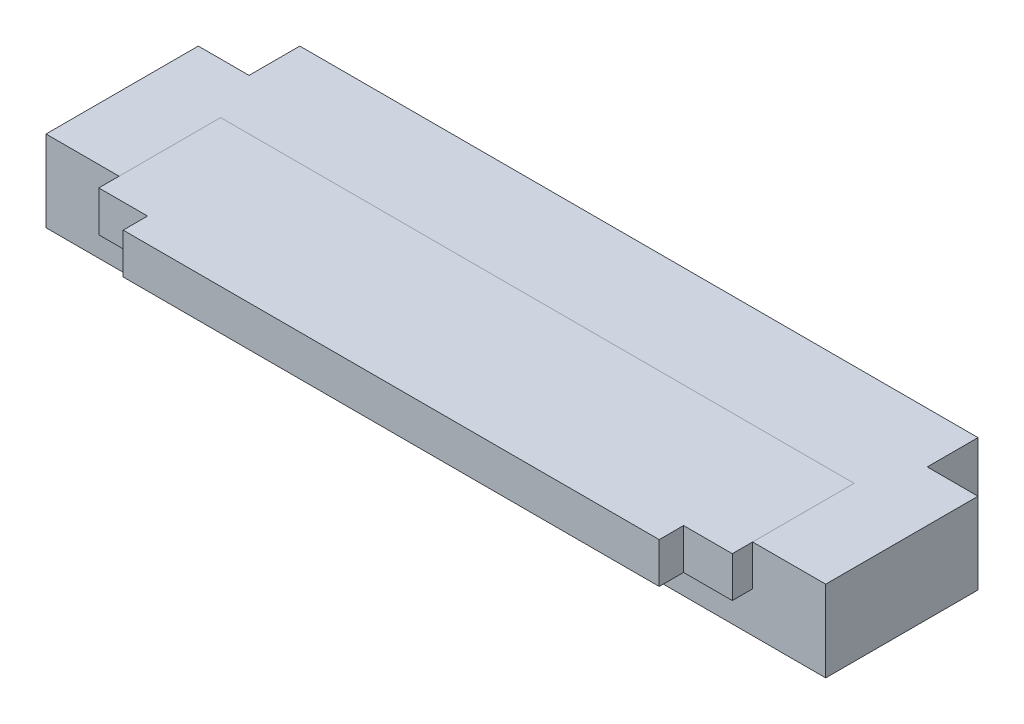
ISO-10303-21;
HEADER;
FILE_DESCRIPTION(('STEP AP214'),'2;1');
FILE_NAME('part.step','',(''),(''),'','','');
FILE_SCHEMA(('AUTOMOTIVE_DESIGN { 1 0 10303 214 1 1 1 1 }'));
ENDSEC;
DATA;
#1=APPLICATION_CONTEXT('core data for automotive mechanical design processes');
#2=APPLICATION_PROTOCOL_DEFINITION('international standard','automotive_design',2000,#1);
#3=PRODUCT_CONTEXT('',#1,'mechanical');
#4=PRODUCT('Part','Part','',(#3));
#5=PRODUCT_RELATED_PRODUCT_CATEGORY('part','',(#4));
#6=PRODUCT_DEFINITION_FORMATION('','',#4);
#7=PRODUCT_DEFINITION_CONTEXT('part definition',#1,'design');
#8=PRODUCT_DEFINITION('design','',#6,#7);
#9=PRODUCT_DEFINITION_SHAPE('','',#8);
#10=(LENGTH_UNIT() NAMED_UNIT(*) SI_UNIT(.MILLI.,.METRE.));
#11=(NAMED_UNIT(*) PLANE_ANGLE_UNIT() SI_UNIT($,.RADIAN.));
#12=(NAMED_UNIT(*) SI_UNIT($,.STERADIAN.) SOLID_ANGLE_UNIT());
#13=UNCERTAINTY_MEASURE_WITH_UNIT(LENGTH_MEASURE(1.E-05),#10,'distance_accuracy_value','');
#14=(GEOMETRIC_REPRESENTATION_CONTEXT(3) GLOBAL_UNCERTAINTY_ASSIGNED_CONTEXT((#13)) GLOBAL_UNIT_ASSIGNED_CONTEXT((#10,
#11,#12)) REPRESENTATION_CONTEXT('',''));
#15=CARTESIAN_POINT('',(0.,0.,0.));
#16=DIRECTION('',(0.,0.,1.));
#17=DIRECTION('',(1.,0.,0.));
#18=AXIS2_PLACEMENT_3D('',#15,#16,#17);
#19=CARTESIAN_POINT('',(-3.8999999978,0.4999999906,0.));
#20=DIRECTION('',(0.,1.,0.));
#21=DIRECTION('',(0.,0.,1.));
#22=AXIS2_PLACEMENT_3D('',#19,#20,#21);
#23=PLANE('',#22);
#24=DIRECTION('',(-1.,0.,0.));
#25=VECTOR('',#24,1.);
#26=CARTESIAN_POINT('',(0.,0.4999999906,0.));
#27=LINE('',#26,#25);
#28=CARTESIAN_POINT('',(3.8999999978,0.4999999906,0.));
#29=VERTEX_POINT('',#28);
#30=CARTESIAN_POINT('',(-3.8999999978,0.4999999906,0.));
#31=VERTEX_POINT('',#30);
#32=EDGE_CURVE('P0_E104',#29,#31,#27,.T.);
#33=ORIENTED_EDGE('',*,*,#32,.T.);
#34=DIRECTION('',(0.,0.,1.));
#35=VECTOR('',#34,1.);
#36=CARTESIAN_POINT('',(-3.8999999978,0.4999999906,0.6249999946));
#37=LINE('',#36,#35);
#38=CARTESIAN_POINT('',(-3.89999999859375,0.499999993775,1.2499999892));
#39=VERTEX_POINT('',#38);
#40=EDGE_CURVE('P0_E20',#31,#39,#37,.T.);
#41=ORIENTED_EDGE('',*,*,#40,.T.);
#42=DIRECTION('',(1.,0.,0.));
#43=VECTOR('',#42,1.);
#44=CARTESIAN_POINT('',(0.,0.5000000033,1.2499999892));
#45=LINE('',#44,#43);
#46=CARTESIAN_POINT('',(3.89999999859375,0.499999993775,1.2499999892));
#47=VERTEX_POINT('',#46);
#48=EDGE_CURVE('P0_E132',#39,#47,#45,.T.);
#49=ORIENTED_EDGE('',*,*,#48,.T.);
#50=DIRECTION('',(0.,0.,-1.));
#51=VECTOR('',#50,1.);
#52=CARTESIAN_POINT('',(3.8999999978,0.4999999906,0.6249999946));
#53=LINE('',#52,#51);
#54=EDGE_CURVE('P0_E121',#47,#29,#53,.T.);
#55=ORIENTED_EDGE('',*,*,#54,.T.);
#56=EDGE_LOOP('',(#33,#41,#49,#55));
#57=FACE_BOUND('',#56,.T.);
#58=ADVANCED_FACE('P0_F16',(#57),#23,.T.);
#59=CARTESIAN_POINT('',(-3.8999999978,0.4999999906,0.));
#60=DIRECTION('',(-1.,0.,0.));
#61=DIRECTION('',(0.,0.,1.));
#62=AXIS2_PLACEMENT_3D('',#59,#60,#61);
#63=PLANE('',#62);
#64=DIRECTION('',(0.,1.,0.));
#65=VECTOR('',#64,1.);
#66=CARTESIAN_POINT('',(-3.8999999978,0.7499999986,0.));
#67=LINE('',#66,#65);
#68=CARTESIAN_POINT('',(-3.89999999859375,1.0000000066,0.));
#69=VERTEX_POINT('',#68);
#70=EDGE_CURVE('P0_E112',#31,#69,#67,.T.);
#71=ORIENTED_EDGE('',*,*,#70,.T.);
#72=DIRECTION('',(0.,0.,-1.));
#73=VECTOR('',#72,1.);
#74=CARTESIAN_POINT('',(-3.900000000975,1.0000000066,0.));
#75=LINE('',#74,#73);
#76=CARTESIAN_POINT('',(-3.8999999993875,1.0000000066,1.2499999892));
#77=VERTEX_POINT('',#76);
#78=EDGE_CURVE('P0_E152',#77,#69,#75,.T.);
#79=ORIENTED_EDGE('',*,*,#78,.F.);
#80=DIRECTION('',(0.,-1.,0.));
#81=VECTOR('',#80,1.);
#82=CARTESIAN_POINT('',(-3.900000000975,0.5000000033,1.2499999892));
#83=LINE('',#82,#81);
#84=EDGE_CURVE('P0_E114',#77,#39,#83,.T.);
#85=ORIENTED_EDGE('',*,*,#84,.T.);
#86=ORIENTED_EDGE('',*,*,#40,.F.);
#87=EDGE_LOOP('',(#71,#79,#85,#86));
#88=FACE_BOUND('',#87,.T.);
#89=ADVANCED_FACE('P0_F110',(#88),#63,.F.);
#90=CARTESIAN_POINT('',(3.8999999978,0.4999999906,0.));
#91=DIRECTION('',(0.,0.,-1.));
#92=DIRECTION('',(-1.,0.,0.));
#93=AXIS2_PLACEMENT_3D('',#90,#91,#92);
#94=PLANE('',#93);
#95=DIRECTION('',(0.,1.,0.));
#96=VECTOR('',#95,1.);
#97=CARTESIAN_POINT('',(3.8999999978,0.7499999986,0.));
#98=LINE('',#97,#96);
#99=CARTESIAN_POINT('',(3.89999999859375,1.0000000066,0.));
#100=VERTEX_POINT('',#99);
#101=EDGE_CURVE('P0_E123',#29,#100,#98,.T.);
#102=ORIENTED_EDGE('',*,*,#101,.T.);
#103=DIRECTION('',(1.,0.,0.));
#104=VECTOR('',#103,1.);
#105=CARTESIAN_POINT('',(0.,1.0000000066,0.));
#106=LINE('',#105,#104);
#107=EDGE_CURVE('P0_E119',#69,#100,#106,.T.);
#108=ORIENTED_EDGE('',*,*,#107,.F.);
#109=ORIENTED_EDGE('',*,*,#70,.F.);
#110=ORIENTED_EDGE('',*,*,#32,.F.);
#111=EDGE_LOOP('',(#102,#108,#109,#110));
#112=FACE_BOUND('',#111,.T.);
#113=ADVANCED_FACE('P0_F118',(#112),#94,.F.);
#114=CARTESIAN_POINT('',(3.8999999978,0.4999999906,1.2499999892));
#115=DIRECTION('',(1.,0.,0.));
#116=DIRECTION('',(0.,0.,-1.));
#117=AXIS2_PLACEMENT_3D('',#114,#115,#116);
#118=PLANE('',#117);
#119=ORIENTED_EDGE('',*,*,#101,.F.);
#120=ORIENTED_EDGE('',*,*,#54,.F.);
#121=DIRECTION('',(0.,1.,0.));
#122=VECTOR('',#121,1.);
#123=CARTESIAN_POINT('',(3.900000000975,0.5000000033,1.2499999892));
#124=LINE('',#123,#122);
#125=CARTESIAN_POINT('',(3.8999999993875,1.0000000066,1.2499999892));
#126=VERTEX_POINT('',#125);
#127=EDGE_CURVE('P0_E127',#47,#126,#124,.T.);
#128=ORIENTED_EDGE('',*,*,#127,.T.);
#129=DIRECTION('',(0.,0.,1.));
#130=VECTOR('',#129,1.);
#131=CARTESIAN_POINT('',(3.900000000975,1.0000000066,0.));
#132=LINE('',#131,#130);
#133=EDGE_CURVE('P0_E155',#100,#126,#132,.T.);
#134=ORIENTED_EDGE('',*,*,#133,.F.);
#135=EDGE_LOOP('',(#119,#120,#128,#134));
#136=FACE_BOUND('',#135,.T.);
#137=ADVANCED_FACE('P0_F221',(#136),#118,.F.);
#138=CARTESIAN_POINT('',(4.8000000012,0.,1.2499999892));
#139=DIRECTION('',(0.,0.,-1.));
#140=DIRECTION('',(-1.,0.,0.));
#141=AXIS2_PLACEMENT_3D('',#138,#139,#140);
#142=PLANE('',#141);
#143=ORIENTED_EDGE('',*,*,#84,.F.);
#144=DIRECTION('',(1.,0.,0.));
#145=VECTOR('',#144,1.);
#146=CARTESIAN_POINT('',(0.,1.0000000066,1.2499999892));
#147=LINE('',#146,#145);
#148=CARTESIAN_POINT('',(-4.8000000012,1.0000000066,1.2499999892));
#149=VERTEX_POINT('',#148);
#150=EDGE_CURVE('P0_E171',#149,#77,#147,.T.);
#151=ORIENTED_EDGE('',*,*,#150,.F.);
#152=DIRECTION('',(0.,1.,0.));
#153=VECTOR('',#152,1.);
#154=CARTESIAN_POINT('',(-4.8000000012,0.5000000033,1.2499999892));
#155=LINE('',#154,#153);
#156=CARTESIAN_POINT('',(-4.8000000012,0.,1.2499999892));
#157=VERTEX_POINT('',#156);
#158=EDGE_CURVE('P0_E35',#157,#149,#155,.T.);
#159=ORIENTED_EDGE('',*,*,#158,.F.);
#160=DIRECTION('',(1.,0.,0.));
#161=VECTOR('',#160,1.);
#162=CARTESIAN_POINT('',(0.,0.,1.2499999892));
#163=LINE('',#162,#161);
#164=CARTESIAN_POINT('',(4.8000000012,0.,1.2499999892));
#165=VERTEX_POINT('',#164);
#166=EDGE_CURVE('P0_E174',#157,#165,#163,.T.);
#167=ORIENTED_EDGE('',*,*,#166,.T.);
#168=DIRECTION('',(0.,1.,0.));
#169=VECTOR('',#168,1.);
#170=CARTESIAN_POINT('',(4.8000000012,0.5000000033,1.2499999892));
#171=LINE('',#170,#169);
#172=CARTESIAN_POINT('',(4.8000000012,1.0000000066,1.2499999892));
#173=VERTEX_POINT('',#172);
#174=EDGE_CURVE('P0_E134',#165,#173,#171,.T.);
#175=ORIENTED_EDGE('',*,*,#174,.T.);
#176=DIRECTION('',(1.,0.,0.));
#177=VECTOR('',#176,1.);
#178=CARTESIAN_POINT('',(0.,1.0000000066,1.2499999892));
#179=LINE('',#178,#177);
#180=EDGE_CURVE('P0_E157',#126,#173,#179,.T.);
#181=ORIENTED_EDGE('',*,*,#180,.F.);
#182=ORIENTED_EDGE('',*,*,#127,.F.);
#183=ORIENTED_EDGE('',*,*,#48,.F.);
#184=EDGE_LOOP('',(#143,#151,#159,#167,#175,#181,#182,#183));
#185=FACE_BOUND('',#184,.T.);
#186=ADVANCED_FACE('P0_F212',(#185),#142,.F.);
#187=CARTESIAN_POINT('',(4.8000000012,0.,-0.6249999946));
#188=DIRECTION('',(-1.,0.,0.));
#189=DIRECTION('',(0.,0.,1.));
#190=AXIS2_PLACEMENT_3D('',#187,#188,#189);
#191=PLANE('',#190);
#192=DIRECTION('',(0.,1.,0.));
#193=VECTOR('',#192,1.);
#194=CARTESIAN_POINT('',(4.8000000012,0.5000000033,-0.6249999946));
#195=LINE('',#194,#193);
#196=CARTESIAN_POINT('',(4.8000000012,0.,-0.6249999946));
#197=VERTEX_POINT('',#196);
#198=CARTESIAN_POINT('',(4.8000000012,1.0000000066,-0.6249999946));
#199=VERTEX_POINT('',#198);
#200=EDGE_CURVE('P0_E137',#197,#199,#195,.T.);
#201=ORIENTED_EDGE('',*,*,#200,.T.);
#202=DIRECTION('',(0.,0.,-1.));
#203=VECTOR('',#202,1.);
#204=CARTESIAN_POINT('',(4.8000000012,1.0000000066,0.));
#205=LINE('',#204,#203);
#206=EDGE_CURVE('P0_E159',#173,#199,#205,.T.);
#207=ORIENTED_EDGE('',*,*,#206,.F.);
#208=ORIENTED_EDGE('',*,*,#174,.F.);
#209=DIRECTION('',(0.,0.,-1.));
#210=VECTOR('',#209,1.);
#211=CARTESIAN_POINT('',(4.8000000012,0.,0.));
#212=LINE('',#211,#210);
#213=EDGE_CURVE('P0_E176',#165,#197,#212,.T.);
#214=ORIENTED_EDGE('',*,*,#213,.T.);
#215=EDGE_LOOP('',(#201,#207,#208,#214));
#216=FACE_BOUND('',#215,.T.);
#217=ADVANCED_FACE('P0_F217',(#216),#191,.F.);
#218=CARTESIAN_POINT('',(4.1750000066,0.,-0.6249999946));
#219=DIRECTION('',(0.,0.,1.));
#220=DIRECTION('',(1.,0.,0.));
#221=AXIS2_PLACEMENT_3D('',#218,#219,#220);
#222=PLANE('',#221);
#223=DIRECTION('',(0.,1.,0.));
#224=VECTOR('',#223,1.);
#225=CARTESIAN_POINT('',(4.1750000066,0.5000000033,-0.6249999946));
#226=LINE('',#225,#224);
#227=CARTESIAN_POINT('',(4.17500000441094,0.,-0.6249999946));
#228=VERTEX_POINT('',#227);
#229=CARTESIAN_POINT('',(4.17500000441094,1.0000000066,-0.6249999946));
#230=VERTEX_POINT('',#229);
#231=EDGE_CURVE('P0_E140',#228,#230,#226,.T.);
#232=ORIENTED_EDGE('',*,*,#231,.T.);
#233=DIRECTION('',(-1.,0.,0.));
#234=VECTOR('',#233,1.);
#235=CARTESIAN_POINT('',(0.,1.0000000066,-0.6249999946));
#236=LINE('',#235,#234);
#237=EDGE_CURVE('P0_E161',#199,#230,#236,.T.);
#238=ORIENTED_EDGE('',*,*,#237,.F.);
#239=ORIENTED_EDGE('',*,*,#200,.F.);
#240=DIRECTION('',(-1.,0.,0.));
#241=VECTOR('',#240,1.);
#242=CARTESIAN_POINT('',(0.,0.,-0.6249999946));
#243=LINE('',#242,#241);
#244=EDGE_CURVE('P0_E179',#197,#228,#243,.T.);
#245=ORIENTED_EDGE('',*,*,#244,.T.);
#246=EDGE_LOOP('',(#232,#238,#239,#245));
#247=FACE_BOUND('',#246,.T.);
#248=ADVANCED_FACE('P0_F251',(#247),#222,.F.);
#249=CARTESIAN_POINT('',(4.1750000066,0.,-1.2499999892));
#250=DIRECTION('',(-1.,0.,0.));
#251=DIRECTION('',(0.,0.,1.));
#252=AXIS2_PLACEMENT_3D('',#249,#250,#251);
#253=PLANE('',#252);
#254=DIRECTION('',(0.,1.,0.));
#255=VECTOR('',#254,1.);
#256=CARTESIAN_POINT('',(4.1750000066,0.5000000033,-1.2499999892));
#257=LINE('',#256,#255);
#258=CARTESIAN_POINT('',(4.17500000441094,0.,-1.2499999892));
#259=VERTEX_POINT('',#258);
#260=CARTESIAN_POINT('',(4.17500000441094,1.0000000066,-1.2499999892));
#261=VERTEX_POINT('',#260);
#262=EDGE_CURVE('P0_E143',#259,#261,#257,.T.);
#263=ORIENTED_EDGE('',*,*,#262,.T.);
#264=DIRECTION('',(0.,0.,-1.));
#265=VECTOR('',#264,1.);
#266=CARTESIAN_POINT('',(4.17499999784375,1.0000000066,0.));
#267=LINE('',#266,#265);
#268=EDGE_CURVE('P0_E163',#230,#261,#267,.T.);
#269=ORIENTED_EDGE('',*,*,#268,.F.);
#270=ORIENTED_EDGE('',*,*,#231,.F.);
#271=DIRECTION('',(0.,0.,-1.));
#272=VECTOR('',#271,1.);
#273=CARTESIAN_POINT('',(4.17499999784375,0.,0.));
#274=LINE('',#273,#272);
#275=EDGE_CURVE('P0_E182',#228,#259,#274,.T.);
#276=ORIENTED_EDGE('',*,*,#275,.T.);
#277=EDGE_LOOP('',(#263,#269,#270,#276));
#278=FACE_BOUND('',#277,.T.);
#279=ADVANCED_FACE('P0_F247',(#278),#253,.F.);
#280=CARTESIAN_POINT('',(-4.1750000066,0.,-1.2499999892));
#281=DIRECTION('',(0.,0.,1.));
#282=DIRECTION('',(1.,0.,0.));
#283=AXIS2_PLACEMENT_3D('',#280,#281,#282);
#284=PLANE('',#283);
#285=DIRECTION('',(0.,1.,0.));
#286=VECTOR('',#285,1.);
#287=CARTESIAN_POINT('',(-4.1750000066,0.5000000033,-1.2499999892));
#288=LINE('',#287,#286);
#289=CARTESIAN_POINT('',(-4.17500000441094,0.,-1.2499999892));
#290=VERTEX_POINT('',#289);
#291=CARTESIAN_POINT('',(-4.17500000441094,1.0000000066,-1.2499999892));
#292=VERTEX_POINT('',#291);
#293=EDGE_CURVE('P0_E146',#290,#292,#288,.T.);
#294=ORIENTED_EDGE('',*,*,#293,.T.);
#295=DIRECTION('',(-1.,0.,0.));
#296=VECTOR('',#295,1.);
#297=CARTESIAN_POINT('',(0.,1.0000000066,-1.2499999892));
#298=LINE('',#297,#296);
#299=EDGE_CURVE('P0_E165',#261,#292,#298,.T.);
#300=ORIENTED_EDGE('',*,*,#299,.F.);
#301=ORIENTED_EDGE('',*,*,#262,.F.);
#302=DIRECTION('',(-1.,0.,0.));
#303=VECTOR('',#302,1.);
#304=CARTESIAN_POINT('',(0.,0.,-1.2499999892));
#305=LINE('',#304,#303);
#306=EDGE_CURVE('P0_E185',#259,#290,#305,.T.);
#307=ORIENTED_EDGE('',*,*,#306,.T.);
#308=EDGE_LOOP('',(#294,#300,#301,#307));
#309=FACE_BOUND('',#308,.T.);
#310=ADVANCED_FACE('P0_F243',(#309),#284,.F.);
#311=CARTESIAN_POINT('',(-4.1750000066,0.,-0.6249999946));
#312=DIRECTION('',(1.,0.,0.));
#313=DIRECTION('',(0.,0.,-1.));
#314=AXIS2_PLACEMENT_3D('',#311,#312,#313);
#315=PLANE('',#314);
#316=DIRECTION('',(0.,1.,0.));
#317=VECTOR('',#316,1.);
#318=CARTESIAN_POINT('',(-4.1750000066,0.5000000033,-0.6249999946));
#319=LINE('',#318,#317);
#320=CARTESIAN_POINT('',(-4.17500000441094,0.,-0.6249999946));
#321=VERTEX_POINT('',#320);
#322=CARTESIAN_POINT('',(-4.17500000441094,1.0000000066,-0.6249999946));
#323=VERTEX_POINT('',#322);
#324=EDGE_CURVE('P0_E149',#321,#323,#319,.T.);
#325=ORIENTED_EDGE('',*,*,#324,.T.);
#326=DIRECTION('',(0.,0.,1.));
#327=VECTOR('',#326,1.);
#328=CARTESIAN_POINT('',(-4.17499999784375,1.0000000066,0.));
#329=LINE('',#328,#327);
#330=EDGE_CURVE('P0_E167',#292,#323,#329,.T.);
#331=ORIENTED_EDGE('',*,*,#330,.F.);
#332=ORIENTED_EDGE('',*,*,#293,.F.);
#333=DIRECTION('',(0.,0.,1.));
#334=VECTOR('',#333,1.);
#335=CARTESIAN_POINT('',(-4.17499999784375,0.,0.));
#336=LINE('',#335,#334);
#337=EDGE_CURVE('P0_E188',#290,#321,#336,.T.);
#338=ORIENTED_EDGE('',*,*,#337,.T.);
#339=EDGE_LOOP('',(#325,#331,#332,#338));
#340=FACE_BOUND('',#339,.T.);
#341=ADVANCED_FACE('P0_F240',(#340),#315,.F.);
#342=CARTESIAN_POINT('',(-4.8000000012,0.,-0.6249999946));
#343=DIRECTION('',(0.,0.,1.));
#344=DIRECTION('',(1.,0.,0.));
#345=AXIS2_PLACEMENT_3D('',#342,#343,#344);
#346=PLANE('',#345);
#347=DIRECTION('',(0.,1.,0.));
#348=VECTOR('',#347,1.);
#349=CARTESIAN_POINT('',(-4.8000000012,0.5000000033,-0.6249999946));
#350=LINE('',#349,#348);
#351=CARTESIAN_POINT('',(-4.8000000012,0.,-0.6249999946));
#352=VERTEX_POINT('',#351);
#353=CARTESIAN_POINT('',(-4.8000000012,1.0000000066,-0.6249999946));
#354=VERTEX_POINT('',#353);
#355=EDGE_CURVE('P0_E194',#352,#354,#350,.T.);
#356=ORIENTED_EDGE('',*,*,#355,.T.);
#357=DIRECTION('',(-1.,0.,0.));
#358=VECTOR('',#357,1.);
#359=CARTESIAN_POINT('',(0.,1.0000000066,-0.6249999946));
#360=LINE('',#359,#358);
#361=EDGE_CURVE('P0_E169',#323,#354,#360,.T.);
#362=ORIENTED_EDGE('',*,*,#361,.F.);
#363=ORIENTED_EDGE('',*,*,#324,.F.);
#364=DIRECTION('',(-1.,0.,0.));
#365=VECTOR('',#364,1.);
#366=CARTESIAN_POINT('',(0.,0.,-0.6249999946));
#367=LINE('',#366,#365);
#368=EDGE_CURVE('P0_E191',#321,#352,#367,.T.);
#369=ORIENTED_EDGE('',*,*,#368,.T.);
#370=EDGE_LOOP('',(#356,#362,#363,#369));
#371=FACE_BOUND('',#370,.T.);
#372=ADVANCED_FACE('P0_F205',(#371),#346,.F.);
#373=CARTESIAN_POINT('',(-4.8000000012,1.0000000066,-1.2499999892));
#374=DIRECTION('',(0.,1.,0.));
#375=DIRECTION('',(0.,0.,1.));
#376=AXIS2_PLACEMENT_3D('',#373,#374,#375);
#377=PLANE('',#376);
#378=DIRECTION('',(0.,0.,1.));
#379=VECTOR('',#378,1.);
#380=CARTESIAN_POINT('',(-4.8000000012,1.0000000066,0.3124999973));
#381=LINE('',#380,#379);
#382=EDGE_CURVE('P0_E26',#354,#149,#381,.T.);
#383=ORIENTED_EDGE('',*,*,#382,.T.);
#384=ORIENTED_EDGE('',*,*,#150,.T.);
#385=ORIENTED_EDGE('',*,*,#78,.T.);
#386=ORIENTED_EDGE('',*,*,#107,.T.);
#387=ORIENTED_EDGE('',*,*,#133,.T.);
#388=ORIENTED_EDGE('',*,*,#180,.T.);
#389=ORIENTED_EDGE('',*,*,#206,.T.);
#390=ORIENTED_EDGE('',*,*,#237,.T.);
#391=ORIENTED_EDGE('',*,*,#268,.T.);
#392=ORIENTED_EDGE('',*,*,#299,.T.);
#393=ORIENTED_EDGE('',*,*,#330,.T.);
#394=ORIENTED_EDGE('',*,*,#361,.T.);
#395=EDGE_LOOP('',(#383,#384,#385,#386,#387,#388,#389,#390,#391,#392,#393,#394));
#396=FACE_BOUND('',#395,.T.);
#397=ADVANCED_FACE('P0_F200',(#396),#377,.T.);
#398=CARTESIAN_POINT('',(-4.8000000012,0.,-1.2499999892));
#399=DIRECTION('',(0.,1.,0.));
#400=DIRECTION('',(0.,0.,1.));
#401=AXIS2_PLACEMENT_3D('',#398,#399,#400);
#402=PLANE('',#401);
#403=ORIENTED_EDGE('',*,*,#368,.F.);
#404=ORIENTED_EDGE('',*,*,#337,.F.);
#405=ORIENTED_EDGE('',*,*,#306,.F.);
#406=ORIENTED_EDGE('',*,*,#275,.F.);
#407=ORIENTED_EDGE('',*,*,#244,.F.);
#408=ORIENTED_EDGE('',*,*,#213,.F.);
#409=ORIENTED_EDGE('',*,*,#166,.F.);
#410=DIRECTION('',(0.,0.,-1.));
#411=VECTOR('',#410,1.);
#412=CARTESIAN_POINT('',(-4.8000000012,0.,0.3124999973));
#413=LINE('',#412,#411);
#414=EDGE_CURVE('P0_E11',#157,#352,#413,.T.);
#415=ORIENTED_EDGE('',*,*,#414,.T.);
#416=EDGE_LOOP('',(#403,#404,#405,#406,#407,#408,#409,#415));
#417=FACE_BOUND('',#416,.T.);
#418=ADVANCED_FACE('P0_F209',(#417),#402,.F.);
#419=CARTESIAN_POINT('',(-4.8000000012,0.,1.2499999892));
#420=DIRECTION('',(1.,0.,0.));
#421=DIRECTION('',(0.,0.,-1.));
#422=AXIS2_PLACEMENT_3D('',#419,#420,#421);
#423=PLANE('',#422);
#424=ORIENTED_EDGE('',*,*,#158,.T.);
#425=ORIENTED_EDGE('',*,*,#382,.F.);
#426=ORIENTED_EDGE('',*,*,#355,.F.);
#427=ORIENTED_EDGE('',*,*,#414,.F.);
#428=EDGE_LOOP('',(#424,#425,#426,#427));
#429=FACE_BOUND('',#428,.T.);
#430=ADVANCED_FACE('P0_F18',(#429),#423,.F.);
#431=CLOSED_SHELL('',(#58,#89,#113,#137,#186,#217,#248,#279,#310,#341,#372,#397,#418,#430));
#432=MANIFOLD_SOLID_BREP('P0_B1',#431);
#433=CARTESIAN_POINT('',(-3.8999999978,1.0000000066,0.));
#434=DIRECTION('',(0.,1.,0.));
#435=DIRECTION('',(0.,0.,1.));
#436=AXIS2_PLACEMENT_3D('',#433,#434,#435);
#437=PLANE('',#436);
#438=DIRECTION('',(0.,0.,1.));
#439=VECTOR('',#438,1.);
#440=CARTESIAN_POINT('',(3.8999999978,1.0000000066,0.7499999986));
#441=LINE('',#440,#439);
#442=CARTESIAN_POINT('',(3.8999999978,1.0000000066,0.));
#443=VERTEX_POINT('',#442);
#444=CARTESIAN_POINT('',(3.8999999978,1.0000000066,1.50000000113333));
#445=VERTEX_POINT('',#444);
#446=EDGE_CURVE('P1_E95',#443,#445,#441,.T.);
#447=ORIENTED_EDGE('',*,*,#446,.F.);
#448=DIRECTION('',(1.,0.,0.));
#449=VECTOR('',#448,1.);
#450=CARTESIAN_POINT('',(0.,1.0000000066,0.));
#451=LINE('',#450,#449);
#452=CARTESIAN_POINT('',(-3.8999999978,1.0000000066,0.));
#453=VERTEX_POINT('',#452);
#454=EDGE_CURVE('P1_E92',#453,#443,#451,.T.);
#455=ORIENTED_EDGE('',*,*,#454,.F.);
#456=DIRECTION('',(0.,0.,1.));
#457=VECTOR('',#456,1.);
#458=CARTESIAN_POINT('',(-3.8999999978,1.0000000066,0.9000000034));
#459=LINE('',#458,#457);
#460=CARTESIAN_POINT('',(-3.8999999978,1.0000000066,1.50000000113333));
#461=VERTEX_POINT('',#460);
#462=EDGE_CURVE('P1_E19',#453,#461,#459,.T.);
#463=ORIENTED_EDGE('',*,*,#462,.T.);
#464=DIRECTION('',(1.,0.,0.));
#465=VECTOR('',#464,1.);
#466=CARTESIAN_POINT('',(0.,1.0000000066,1.50000000506667));
#467=LINE('',#466,#465);
#468=CARTESIAN_POINT('',(-3.30000000076923,1.0000000066,1.50000000113333));
#469=VERTEX_POINT('',#468);
#470=EDGE_CURVE('P1_E83',#461,#469,#467,.T.);
#471=ORIENTED_EDGE('',*,*,#470,.T.);
#472=DIRECTION('',(0.,0.,1.));
#473=VECTOR('',#472,1.);
#474=CARTESIAN_POINT('',(-3.29999999753846,1.0000000066,0.9000000034));
#475=LINE('',#474,#473);
#476=CARTESIAN_POINT('',(-3.30000000076923,1.0000000066,1.8000000068));
#477=VERTEX_POINT('',#476);
#478=EDGE_CURVE('P1_E78',#469,#477,#475,.T.);
#479=ORIENTED_EDGE('',*,*,#478,.T.);
#480=DIRECTION('',(-1.,0.,0.));
#481=VECTOR('',#480,1.);
#482=CARTESIAN_POINT('',(0.,1.0000000066,1.8000000068));
#483=LINE('',#482,#481);
#484=CARTESIAN_POINT('',(3.30000000076923,1.0000000066,1.8000000068));
#485=VERTEX_POINT('',#484);
#486=EDGE_CURVE('P1_E129',#485,#477,#483,.T.);
#487=ORIENTED_EDGE('',*,*,#486,.F.);
#488=DIRECTION('',(0.,0.,1.));
#489=VECTOR('',#488,1.);
#490=CARTESIAN_POINT('',(3.300000004,1.0000000066,1.650000002));
#491=LINE('',#490,#489);
#492=CARTESIAN_POINT('',(3.30000000076923,1.0000000066,1.50000000113333));
#493=VERTEX_POINT('',#492);
#494=EDGE_CURVE('P1_E126',#493,#485,#491,.T.);
#495=ORIENTED_EDGE('',*,*,#494,.F.);
#496=DIRECTION('',(-1.,0.,0.));
#497=VECTOR('',#496,1.);
#498=CARTESIAN_POINT('',(3.6000000009,1.0000000066,1.4999999972));
#499=LINE('',#498,#497);
#500=EDGE_CURVE('P1_E120',#445,#493,#499,.T.);
#501=ORIENTED_EDGE('',*,*,#500,.F.);
#502=EDGE_LOOP('',(#447,#455,#463,#471,#479,#487,#495,#501));
#503=FACE_BOUND('',#502,.T.);
#504=ADVANCED_FACE('P1_F15',(#503),#437,.T.);
#505=CARTESIAN_POINT('',(-3.300000004,0.4999999906,1.8000000068));
#506=DIRECTION('',(0.,0.,1.));
#507=DIRECTION('',(1.,0.,0.));
#508=AXIS2_PLACEMENT_3D('',#505,#506,#507);
#509=PLANE('',#508);
#510=DIRECTION('',(1.,0.,0.));
#511=VECTOR('',#510,1.);
#512=CARTESIAN_POINT('',(0.,0.4999999906,1.8000000068));
#513=LINE('',#512,#511);
#514=CARTESIAN_POINT('',(-3.30000000238462,0.4999999906,1.8000000068));
#515=VERTEX_POINT('',#514);
#516=CARTESIAN_POINT('',(3.30000000238462,0.4999999906,1.8000000068));
#517=VERTEX_POINT('',#516);
#518=EDGE_CURVE('P1_E138',#515,#517,#513,.T.);
#519=ORIENTED_EDGE('',*,*,#518,.T.);
#520=DIRECTION('',(0.,-1.,0.));
#521=VECTOR('',#520,1.);
#522=CARTESIAN_POINT('',(3.300000004,0.7499999986,1.8000000068));
#523=LINE('',#522,#521);
#524=EDGE_CURVE('P1_E123',#485,#517,#523,.T.);
#525=ORIENTED_EDGE('',*,*,#524,.F.);
#526=ORIENTED_EDGE('',*,*,#486,.T.);
#527=DIRECTION('',(0.,1.,0.));
#528=VECTOR('',#527,1.);
#529=CARTESIAN_POINT('',(-3.300000004,0.7499999986,1.8000000068));
#530=LINE('',#529,#528);
#531=EDGE_CURVE('P1_E107',#515,#477,#530,.T.);
#532=ORIENTED_EDGE('',*,*,#531,.F.);
#533=EDGE_LOOP('',(#519,#525,#526,#532));
#534=FACE_BOUND('',#533,.T.);
#535=ADVANCED_FACE('P1_F134',(#534),#509,.T.);
#536=CARTESIAN_POINT('',(3.300000004,0.4999999906,1.8000000068));
#537=DIRECTION('',(1.,0.,0.));
#538=DIRECTION('',(0.,0.,-1.));
#539=AXIS2_PLACEMENT_3D('',#536,#537,#538);
#540=PLANE('',#539);
#541=DIRECTION('',(0.,0.,-1.));
#542=VECTOR('',#541,1.);
#543=CARTESIAN_POINT('',(3.29999999753846,0.4999999906,0.9000000034));
#544=LINE('',#543,#542);
#545=CARTESIAN_POINT('',(3.30000000238462,0.4999999906,1.49999999916667));
#546=VERTEX_POINT('',#545);
#547=EDGE_CURVE('P1_E142',#517,#546,#544,.T.);
#548=ORIENTED_EDGE('',*,*,#547,.T.);
#549=DIRECTION('',(0.,-1.,0.));
#550=VECTOR('',#549,1.);
#551=CARTESIAN_POINT('',(3.300000004,0.7499999986,1.4999999972));
#552=LINE('',#551,#550);
#553=EDGE_CURVE('P1_E117',#493,#546,#552,.T.);
#554=ORIENTED_EDGE('',*,*,#553,.F.);
#555=ORIENTED_EDGE('',*,*,#494,.T.);
#556=ORIENTED_EDGE('',*,*,#524,.T.);
#557=EDGE_LOOP('',(#548,#554,#555,#556));
#558=FACE_BOUND('',#557,.T.);
#559=ADVANCED_FACE('P1_F161',(#558),#540,.T.);
#560=CARTESIAN_POINT('',(3.300000004,0.4999999906,1.4999999972));
#561=DIRECTION('',(0.,0.,1.));
#562=DIRECTION('',(1.,0.,0.));
#563=AXIS2_PLACEMENT_3D('',#560,#561,#562);
#564=PLANE('',#563);
#565=DIRECTION('',(1.,0.,0.));
#566=VECTOR('',#565,1.);
#567=CARTESIAN_POINT('',(0.,0.4999999906,1.50000000506667));
#568=LINE('',#567,#566);
#569=CARTESIAN_POINT('',(3.8999999978,0.4999999906,1.49999999916667));
#570=VERTEX_POINT('',#569);
#571=EDGE_CURVE('P1_E144',#546,#570,#568,.T.);
#572=ORIENTED_EDGE('',*,*,#571,.T.);
#573=DIRECTION('',(0.,-1.,0.));
#574=VECTOR('',#573,1.);
#575=CARTESIAN_POINT('',(3.8999999978,0.7499999986,1.4999999972));
#576=LINE('',#575,#574);
#577=EDGE_CURVE('P1_E100',#445,#570,#576,.T.);
#578=ORIENTED_EDGE('',*,*,#577,.F.);
#579=ORIENTED_EDGE('',*,*,#500,.T.);
#580=ORIENTED_EDGE('',*,*,#553,.T.);
#581=EDGE_LOOP('',(#572,#578,#579,#580));
#582=FACE_BOUND('',#581,.T.);
#583=ADVANCED_FACE('P1_F158',(#582),#564,.T.);
#584=CARTESIAN_POINT('',(3.8999999978,0.4999999906,1.4999999972));
#585=DIRECTION('',(1.,0.,0.));
#586=DIRECTION('',(0.,0.,-1.));
#587=AXIS2_PLACEMENT_3D('',#584,#585,#586);
#588=PLANE('',#587);
#589=DIRECTION('',(0.,0.,-1.));
#590=VECTOR('',#589,1.);
#591=CARTESIAN_POINT('',(3.8999999978,0.4999999906,0.9000000034));
#592=LINE('',#591,#590);
#593=CARTESIAN_POINT('',(3.8999999978,0.4999999906,0.));
#594=VERTEX_POINT('',#593);
#595=EDGE_CURVE('P1_E148',#570,#594,#592,.T.);
#596=ORIENTED_EDGE('',*,*,#595,.T.);
#597=DIRECTION('',(0.,-1.,0.));
#598=VECTOR('',#597,1.);
#599=CARTESIAN_POINT('',(3.8999999978,0.7499999986,0.));
#600=LINE('',#599,#598);
#601=EDGE_CURVE('P1_E99',#443,#594,#600,.T.);
#602=ORIENTED_EDGE('',*,*,#601,.F.);
#603=ORIENTED_EDGE('',*,*,#446,.T.);
#604=ORIENTED_EDGE('',*,*,#577,.T.);
#605=EDGE_LOOP('',(#596,#602,#603,#604));
#606=FACE_BOUND('',#605,.T.);
#607=ADVANCED_FACE('P1_F155',(#606),#588,.T.);
#608=CARTESIAN_POINT('',(3.8999999978,0.4999999906,0.));
#609=DIRECTION('',(0.,0.,-1.));
#610=DIRECTION('',(-1.,0.,0.));
#611=AXIS2_PLACEMENT_3D('',#608,#609,#610);
#612=PLANE('',#611);
#613=DIRECTION('',(-1.,0.,0.));
#614=VECTOR('',#613,1.);
#615=CARTESIAN_POINT('',(0.,0.4999999906,0.));
#616=LINE('',#615,#614);
#617=CARTESIAN_POINT('',(-3.8999999978,0.4999999906,0.));
#618=VERTEX_POINT('',#617);
#619=EDGE_CURVE('P1_E106',#594,#618,#616,.T.);
#620=ORIENTED_EDGE('',*,*,#619,.T.);
#621=DIRECTION('',(0.,1.,0.));
#622=VECTOR('',#621,1.);
#623=CARTESIAN_POINT('',(-3.8999999978,0.7499999986,0.));
#624=LINE('',#623,#622);
#625=EDGE_CURVE('P1_E103',#618,#453,#624,.T.);
#626=ORIENTED_EDGE('',*,*,#625,.T.);
#627=ORIENTED_EDGE('',*,*,#454,.T.);
#628=ORIENTED_EDGE('',*,*,#601,.T.);
#629=EDGE_LOOP('',(#620,#626,#627,#628));
#630=FACE_BOUND('',#629,.T.);
#631=ADVANCED_FACE('P1_F104',(#630),#612,.T.);
#632=CARTESIAN_POINT('',(-3.300000004,0.4999999906,1.4999999972));
#633=DIRECTION('',(-1.,0.,0.));
#634=DIRECTION('',(0.,0.,1.));
#635=AXIS2_PLACEMENT_3D('',#632,#633,#634);
#636=PLANE('',#635);
#637=DIRECTION('',(0.,0.,1.));
#638=VECTOR('',#637,1.);
#639=CARTESIAN_POINT('',(-3.29999999753846,0.4999999906,0.9000000034));
#640=LINE('',#639,#638);
#641=CARTESIAN_POINT('',(-3.30000000076923,0.4999999906,1.50000000113333));
#642=VERTEX_POINT('',#641);
#643=EDGE_CURVE('P1_E109',#642,#515,#640,.T.);
#644=ORIENTED_EDGE('',*,*,#643,.T.);
#645=ORIENTED_EDGE('',*,*,#531,.T.);
#646=ORIENTED_EDGE('',*,*,#478,.F.);
#647=DIRECTION('',(0.,1.,0.));
#648=VECTOR('',#647,1.);
#649=CARTESIAN_POINT('',(-3.300000004,0.7499999986,1.4999999972));
#650=LINE('',#649,#648);
#651=EDGE_CURVE('P1_E86',#642,#469,#650,.T.);
#652=ORIENTED_EDGE('',*,*,#651,.F.);
#653=EDGE_LOOP('',(#644,#645,#646,#652));
#654=FACE_BOUND('',#653,.T.);
#655=ADVANCED_FACE('P1_F136',(#654),#636,.T.);
#656=CARTESIAN_POINT('',(-3.8999999978,0.4999999906,0.));
#657=DIRECTION('',(0.,1.,0.));
#658=DIRECTION('',(0.,0.,1.));
#659=AXIS2_PLACEMENT_3D('',#656,#657,#658);
#660=PLANE('',#659);
#661=ORIENTED_EDGE('',*,*,#619,.F.);
#662=ORIENTED_EDGE('',*,*,#595,.F.);
#663=ORIENTED_EDGE('',*,*,#571,.F.);
#664=ORIENTED_EDGE('',*,*,#547,.F.);
#665=ORIENTED_EDGE('',*,*,#518,.F.);
#666=ORIENTED_EDGE('',*,*,#643,.F.);
#667=DIRECTION('',(1.,0.,0.));
#668=VECTOR('',#667,1.);
#669=CARTESIAN_POINT('',(-3.6000000009,0.4999999906,1.4999999972));
#670=LINE('',#669,#668);
#671=CARTESIAN_POINT('',(-3.8999999978,0.4999999906,1.50000000113333));
#672=VERTEX_POINT('',#671);
#673=EDGE_CURVE('P1_E34',#672,#642,#670,.T.);
#674=ORIENTED_EDGE('',*,*,#673,.F.);
#675=DIRECTION('',(0.,0.,1.));
#676=VECTOR('',#675,1.);
#677=CARTESIAN_POINT('',(-3.8999999978,0.4999999906,0.7499999986));
#678=LINE('',#677,#676);
#679=EDGE_CURVE('P1_E25',#618,#672,#678,.T.);
#680=ORIENTED_EDGE('',*,*,#679,.F.);
#681=EDGE_LOOP('',(#661,#662,#663,#664,#665,#666,#674,#680));
#682=FACE_BOUND('',#681,.T.);
#683=ADVANCED_FACE('P1_F140',(#682),#660,.F.);
#684=CARTESIAN_POINT('',(-3.8999999978,0.4999999906,1.4999999972));
#685=DIRECTION('',(0.,0.,1.));
#686=DIRECTION('',(1.,0.,0.));
#687=AXIS2_PLACEMENT_3D('',#684,#685,#686);
#688=PLANE('',#687);
#689=ORIENTED_EDGE('',*,*,#673,.T.);
#690=ORIENTED_EDGE('',*,*,#651,.T.);
#691=ORIENTED_EDGE('',*,*,#470,.F.);
#692=DIRECTION('',(0.,1.,0.));
#693=VECTOR('',#692,1.);
#694=CARTESIAN_POINT('',(-3.8999999978,0.7499999986,1.4999999972));
#695=LINE('',#694,#693);
#696=EDGE_CURVE('P1_E10',#672,#461,#695,.T.);
#697=ORIENTED_EDGE('',*,*,#696,.F.);
#698=EDGE_LOOP('',(#689,#690,#691,#697));
#699=FACE_BOUND('',#698,.T.);
#700=ADVANCED_FACE('P1_F84',(#699),#688,.T.);
#701=CARTESIAN_POINT('',(-3.8999999978,0.4999999906,0.));
#702=DIRECTION('',(-1.,0.,0.));
#703=DIRECTION('',(0.,0.,1.));
#704=AXIS2_PLACEMENT_3D('',#701,#702,#703);
#705=PLANE('',#704);
#706=ORIENTED_EDGE('',*,*,#679,.T.);
#707=ORIENTED_EDGE('',*,*,#696,.T.);
#708=ORIENTED_EDGE('',*,*,#462,.F.);
#709=ORIENTED_EDGE('',*,*,#625,.F.);
#710=EDGE_LOOP('',(#706,#707,#708,#709));
#711=FACE_BOUND('',#710,.T.);
#712=ADVANCED_FACE('P1_F17',(#711),#705,.T.);
#713=CLOSED_SHELL('',(#504,#535,#559,#583,#607,#631,#655,#683,#700,#712));
#714=MANIFOLD_SOLID_BREP('P1_B1',#713);
#715=ADVANCED_BREP_SHAPE_REPRESENTATION('',(#18,#432,#714),#14);
#716=SHAPE_DEFINITION_REPRESENTATION(#9,#715);
ENDSEC;
END-ISO-10303-21;
